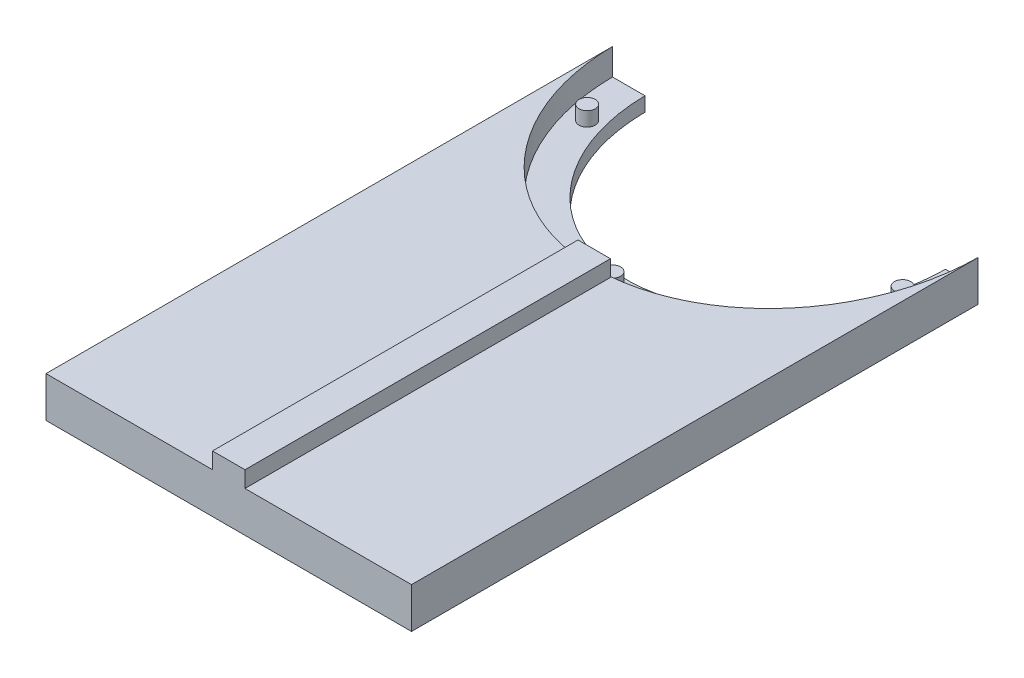
ISO-10303-21;
HEADER;
FILE_DESCRIPTION(('STEP AP214'),'2;1');
FILE_NAME('part.step','',(''),(''),'','','');
FILE_SCHEMA(('AUTOMOTIVE_DESIGN { 1 0 10303 214 1 1 1 1 }'));
ENDSEC;
DATA;
#1=APPLICATION_CONTEXT('core data for automotive mechanical design processes');
#2=APPLICATION_PROTOCOL_DEFINITION('international standard','automotive_design',2000,#1);
#3=PRODUCT_CONTEXT('',#1,'mechanical');
#4=PRODUCT('Part','Part','',(#3));
#5=PRODUCT_RELATED_PRODUCT_CATEGORY('part','',(#4));
#6=PRODUCT_DEFINITION_FORMATION('','',#4);
#7=PRODUCT_DEFINITION_CONTEXT('part definition',#1,'design');
#8=PRODUCT_DEFINITION('design','',#6,#7);
#9=PRODUCT_DEFINITION_SHAPE('','',#8);
#10=(LENGTH_UNIT() NAMED_UNIT(*) SI_UNIT(.MILLI.,.METRE.));
#11=(NAMED_UNIT(*) PLANE_ANGLE_UNIT() SI_UNIT($,.RADIAN.));
#12=(NAMED_UNIT(*) SI_UNIT($,.STERADIAN.) SOLID_ANGLE_UNIT());
#13=UNCERTAINTY_MEASURE_WITH_UNIT(LENGTH_MEASURE(1.E-05),#10,'distance_accuracy_value','');
#14=(GEOMETRIC_REPRESENTATION_CONTEXT(3) GLOBAL_UNCERTAINTY_ASSIGNED_CONTEXT((#13)) GLOBAL_UNIT_ASSIGNED_CONTEXT((#10,
#11,#12)) REPRESENTATION_CONTEXT('',''));
#15=CARTESIAN_POINT('',(0.,0.,0.));
#16=DIRECTION('',(0.,0.,1.));
#17=DIRECTION('',(1.,0.,0.));
#18=AXIS2_PLACEMENT_3D('',#15,#16,#17);
#19=CARTESIAN_POINT('',(0.,10.,0.));
#20=DIRECTION('',(0.,1.,0.));
#21=DIRECTION('',(0.,0.,1.));
#22=AXIS2_PLACEMENT_3D('',#19,#20,#21);
#23=PLANE('',#22);
#24=DIRECTION('',(0.,0.,-1.));
#25=VECTOR('',#24,1.);
#26=CARTESIAN_POINT('',(4.,10.,0.));
#27=LINE('',#26,#25);
#28=CARTESIAN_POINT('',(4.,10.,140.));
#29=VERTEX_POINT('',#28);
#30=CARTESIAN_POINT('',(4.,10.,50.));
#31=VERTEX_POINT('',#30);
#32=EDGE_CURVE('E11',#29,#31,#27,.T.);
#33=ORIENTED_EDGE('',*,*,#32,.F.);
#34=DIRECTION('',(1.,0.,0.));
#35=VECTOR('',#34,1.);
#36=CARTESIAN_POINT('',(0.,10.,140.));
#37=LINE('',#36,#35);
#38=CARTESIAN_POINT('',(45.,10.,140.));
#39=VERTEX_POINT('',#38);
#40=EDGE_CURVE('E232',#29,#39,#37,.T.);
#41=ORIENTED_EDGE('',*,*,#40,.T.);
#42=DIRECTION('',(0.,0.,-1.));
#43=VECTOR('',#42,1.);
#44=CARTESIAN_POINT('',(45.,10.,0.));
#45=LINE('',#44,#43);
#46=CARTESIAN_POINT('',(45.,10.,0.5));
#47=VERTEX_POINT('',#46);
#48=EDGE_CURVE('E351',#39,#47,#45,.T.);
#49=ORIENTED_EDGE('',*,*,#48,.T.);
#50=DIRECTION('',(1.,0.,0.));
#51=VECTOR('',#50,1.);
#52=CARTESIAN_POINT('',(0.,10.,0.5));
#53=LINE('',#52,#51);
#54=CARTESIAN_POINT('',(44.9977499437472,10.,0.5));
#55=VERTEX_POINT('',#54);
#56=EDGE_CURVE('E314',#55,#47,#53,.T.);
#57=ORIENTED_EDGE('',*,*,#56,.F.);
#58=CARTESIAN_POINT('',(0.,10.,0.));
#59=DIRECTION('',(0.,1.,0.));
#60=DIRECTION('',(0.,0.,1.));
#61=AXIS2_PLACEMENT_3D('',#58,#59,#60);
#62=ELLIPSE('',#61,50.,45.);
#63=CARTESIAN_POINT('',(0.,10.,50.));
#64=VERTEX_POINT('',#63);
#65=EDGE_CURVE('E336',#64,#55,#62,.T.);
#66=ORIENTED_EDGE('',*,*,#65,.F.);
#67=DIRECTION('',(-1.,0.,0.));
#68=VECTOR('',#67,1.);
#69=CARTESIAN_POINT('',(0.,10.,50.));
#70=LINE('',#69,#68);
#71=EDGE_CURVE('E62',#31,#64,#70,.T.);
#72=ORIENTED_EDGE('',*,*,#71,.F.);
#73=EDGE_LOOP('',(#33,#41,#49,#57,#66,#72));
#74=FACE_BOUND('',#73,.T.);
#75=ADVANCED_FACE('F45',(#74),#23,.T.);
#76=DIRECTION('',(0.,-1.,0.));
#77=VECTOR('',#76,1.);
#78=SURFACE_OF_LINEAR_EXTRUSION('',#62,#77);
#79=CARTESIAN_POINT('',(0.,3.5,0.));
#80=DIRECTION('',(0.,1.,0.));
#81=DIRECTION('',(0.,0.,1.));
#82=AXIS2_PLACEMENT_3D('',#79,#80,#81);
#83=ELLIPSE('',#82,50.,45.);
#84=CARTESIAN_POINT('',(-44.9977499437472,3.5,0.5));
#85=VERTEX_POINT('',#84);
#86=CARTESIAN_POINT('',(44.9977499437472,3.5,0.5));
#87=VERTEX_POINT('',#86);
#88=EDGE_CURVE('E316',#85,#87,#83,.T.);
#89=ORIENTED_EDGE('',*,*,#88,.F.);
#90=DIRECTION('',(0.,-1.,0.));
#91=VECTOR('',#90,1.);
#92=CARTESIAN_POINT('',(-44.9977499437472,10.,0.5));
#93=LINE('',#92,#91);
#94=CARTESIAN_POINT('',(-44.9977499437472,10.,0.5));
#95=VERTEX_POINT('',#94);
#96=EDGE_CURVE('E220',#95,#85,#93,.T.);
#97=ORIENTED_EDGE('',*,*,#96,.F.);
#98=EDGE_CURVE('E337',#95,#64,#62,.T.);
#99=ORIENTED_EDGE('',*,*,#98,.T.);
#100=ORIENTED_EDGE('',*,*,#65,.T.);
#101=DIRECTION('',(0.,-1.,0.));
#102=VECTOR('',#101,1.);
#103=CARTESIAN_POINT('',(44.9977499437472,10.,0.5));
#104=LINE('',#103,#102);
#105=EDGE_CURVE('E309',#55,#87,#104,.T.);
#106=ORIENTED_EDGE('',*,*,#105,.T.);
#107=EDGE_LOOP('',(#89,#97,#99,#100,#106));
#108=FACE_BOUND('',#107,.T.);
#109=ADVANCED_FACE('F47',(#108),#78,.T.);
#110=CARTESIAN_POINT('',(0.,10.,0.5));
#111=DIRECTION('',(0.,0.,-1.));
#112=DIRECTION('',(-1.,0.,0.));
#113=AXIS2_PLACEMENT_3D('',#110,#111,#112);
#114=PLANE('',#113);
#115=DIRECTION('',(1.,0.,0.));
#116=VECTOR('',#115,1.);
#117=CARTESIAN_POINT('',(0.,0.,0.5));
#118=LINE('',#117,#116);
#119=CARTESIAN_POINT('',(-45.,0.,0.5));
#120=VERTEX_POINT('',#119);
#121=CARTESIAN_POINT('',(-36.9973577680352,0.,0.5));
#122=VERTEX_POINT('',#121);
#123=EDGE_CURVE('E276',#120,#122,#118,.T.);
#124=ORIENTED_EDGE('',*,*,#123,.F.);
#125=DIRECTION('',(0.,-1.,0.));
#126=VECTOR('',#125,1.);
#127=CARTESIAN_POINT('',(-45.,10.,0.5));
#128=LINE('',#127,#126);
#129=CARTESIAN_POINT('',(-45.,10.,0.5));
#130=VERTEX_POINT('',#129);
#131=EDGE_CURVE('E279',#130,#120,#128,.T.);
#132=ORIENTED_EDGE('',*,*,#131,.F.);
#133=EDGE_CURVE('E341',#130,#95,#53,.T.);
#134=ORIENTED_EDGE('',*,*,#133,.T.);
#135=ORIENTED_EDGE('',*,*,#96,.T.);
#136=DIRECTION('',(1.,0.,0.));
#137=VECTOR('',#136,1.);
#138=CARTESIAN_POINT('',(0.,3.5,0.5));
#139=LINE('',#138,#137);
#140=CARTESIAN_POINT('',(-36.9973577680352,3.5,0.5));
#141=VERTEX_POINT('',#140);
#142=EDGE_CURVE('E201',#85,#141,#139,.T.);
#143=ORIENTED_EDGE('',*,*,#142,.T.);
#144=DIRECTION('',(0.,-1.,0.));
#145=VECTOR('',#144,1.);
#146=CARTESIAN_POINT('',(-36.9973577680352,3.5,0.5));
#147=LINE('',#146,#145);
#148=EDGE_CURVE('E282',#141,#122,#147,.T.);
#149=ORIENTED_EDGE('',*,*,#148,.T.);
#150=EDGE_LOOP('',(#124,#132,#134,#135,#143,#149));
#151=FACE_BOUND('',#150,.T.);
#152=ADVANCED_FACE('F246',(#151),#114,.T.);
#153=CARTESIAN_POINT('',(-45.,10.,0.));
#154=DIRECTION('',(-1.,0.,0.));
#155=DIRECTION('',(0.,0.,1.));
#156=AXIS2_PLACEMENT_3D('',#153,#154,#155);
#157=PLANE('',#156);
#158=DIRECTION('',(0.,0.,-1.));
#159=VECTOR('',#158,1.);
#160=CARTESIAN_POINT('',(-45.,0.,0.));
#161=LINE('',#160,#159);
#162=CARTESIAN_POINT('',(-45.,0.,140.));
#163=VERTEX_POINT('',#162);
#164=EDGE_CURVE('E286',#163,#120,#161,.T.);
#165=ORIENTED_EDGE('',*,*,#164,.F.);
#166=DIRECTION('',(0.,-1.,0.));
#167=VECTOR('',#166,1.);
#168=CARTESIAN_POINT('',(-45.,10.,140.));
#169=LINE('',#168,#167);
#170=CARTESIAN_POINT('',(-45.,10.,140.));
#171=VERTEX_POINT('',#170);
#172=EDGE_CURVE('E363',#171,#163,#169,.T.);
#173=ORIENTED_EDGE('',*,*,#172,.F.);
#174=DIRECTION('',(0.,0.,-1.));
#175=VECTOR('',#174,1.);
#176=CARTESIAN_POINT('',(-45.,10.,0.));
#177=LINE('',#176,#175);
#178=EDGE_CURVE('E238',#171,#130,#177,.T.);
#179=ORIENTED_EDGE('',*,*,#178,.T.);
#180=ORIENTED_EDGE('',*,*,#131,.T.);
#181=EDGE_LOOP('',(#165,#173,#179,#180));
#182=FACE_BOUND('',#181,.T.);
#183=ADVANCED_FACE('F268',(#182),#157,.T.);
#184=CARTESIAN_POINT('',(0.,10.,140.));
#185=DIRECTION('',(0.,0.,-1.));
#186=DIRECTION('',(-1.,0.,0.));
#187=AXIS2_PLACEMENT_3D('',#184,#185,#186);
#188=PLANE('',#187);
#189=ORIENTED_EDGE('',*,*,#40,.F.);
#190=DIRECTION('',(0.,1.,0.));
#191=VECTOR('',#190,1.);
#192=CARTESIAN_POINT('',(4.,6.,140.));
#193=LINE('',#192,#191);
#194=CARTESIAN_POINT('',(4.,14.,140.));
#195=VERTEX_POINT('',#194);
#196=EDGE_CURVE('E168',#29,#195,#193,.T.);
#197=ORIENTED_EDGE('',*,*,#196,.T.);
#198=DIRECTION('',(-1.,0.,0.));
#199=VECTOR('',#198,1.);
#200=CARTESIAN_POINT('',(-4.,14.,140.));
#201=LINE('',#200,#199);
#202=CARTESIAN_POINT('',(-4.,14.,140.));
#203=VERTEX_POINT('',#202);
#204=EDGE_CURVE('E155',#195,#203,#201,.T.);
#205=ORIENTED_EDGE('',*,*,#204,.T.);
#206=DIRECTION('',(0.,-1.,0.));
#207=VECTOR('',#206,1.);
#208=CARTESIAN_POINT('',(-4.,6.,140.));
#209=LINE('',#208,#207);
#210=CARTESIAN_POINT('',(-4.,10.,140.));
#211=VERTEX_POINT('',#210);
#212=EDGE_CURVE('E149',#203,#211,#209,.T.);
#213=ORIENTED_EDGE('',*,*,#212,.T.);
#214=EDGE_CURVE('E237',#171,#211,#37,.T.);
#215=ORIENTED_EDGE('',*,*,#214,.F.);
#216=ORIENTED_EDGE('',*,*,#172,.T.);
#217=DIRECTION('',(1.,0.,0.));
#218=VECTOR('',#217,1.);
#219=CARTESIAN_POINT('',(0.,0.,140.));
#220=LINE('',#219,#218);
#221=CARTESIAN_POINT('',(45.,0.,140.));
#222=VERTEX_POINT('',#221);
#223=EDGE_CURVE('E293',#163,#222,#220,.T.);
#224=ORIENTED_EDGE('',*,*,#223,.T.);
#225=DIRECTION('',(0.,-1.,0.));
#226=VECTOR('',#225,1.);
#227=CARTESIAN_POINT('',(45.,10.,140.));
#228=LINE('',#227,#226);
#229=EDGE_CURVE('E234',#39,#222,#228,.T.);
#230=ORIENTED_EDGE('',*,*,#229,.F.);
#231=EDGE_LOOP('',(#189,#197,#205,#213,#215,#216,#224,#230));
#232=FACE_BOUND('',#231,.T.);
#233=ADVANCED_FACE('F230',(#232),#188,.F.);
#234=CARTESIAN_POINT('',(45.,10.,0.));
#235=DIRECTION('',(-1.,0.,0.));
#236=DIRECTION('',(0.,0.,1.));
#237=AXIS2_PLACEMENT_3D('',#234,#235,#236);
#238=PLANE('',#237);
#239=DIRECTION('',(0.,0.,-1.));
#240=VECTOR('',#239,1.);
#241=CARTESIAN_POINT('',(45.,0.,0.));
#242=LINE('',#241,#240);
#243=CARTESIAN_POINT('',(45.,0.,0.5));
#244=VERTEX_POINT('',#243);
#245=EDGE_CURVE('E297',#222,#244,#242,.T.);
#246=ORIENTED_EDGE('',*,*,#245,.T.);
#247=DIRECTION('',(0.,-1.,0.));
#248=VECTOR('',#247,1.);
#249=CARTESIAN_POINT('',(45.,10.,0.5));
#250=LINE('',#249,#248);
#251=EDGE_CURVE('E306',#47,#244,#250,.T.);
#252=ORIENTED_EDGE('',*,*,#251,.F.);
#253=ORIENTED_EDGE('',*,*,#48,.F.);
#254=ORIENTED_EDGE('',*,*,#229,.T.);
#255=EDGE_LOOP('',(#246,#252,#253,#254));
#256=FACE_BOUND('',#255,.T.);
#257=ADVANCED_FACE('F259',(#256),#238,.F.);
#258=CARTESIAN_POINT('',(36.9973577680352,0.,0.5));
#259=VERTEX_POINT('',#258);
#260=EDGE_CURVE('E289',#259,#244,#118,.T.);
#261=ORIENTED_EDGE('',*,*,#260,.F.);
#262=DIRECTION('',(0.,-1.,0.));
#263=VECTOR('',#262,1.);
#264=CARTESIAN_POINT('',(36.9973577680352,3.5,0.5));
#265=LINE('',#264,#263);
#266=CARTESIAN_POINT('',(36.9973577680352,3.5,0.5));
#267=VERTEX_POINT('',#266);
#268=EDGE_CURVE('E287',#267,#259,#265,.T.);
#269=ORIENTED_EDGE('',*,*,#268,.F.);
#270=EDGE_CURVE('E204',#267,#87,#139,.T.);
#271=ORIENTED_EDGE('',*,*,#270,.T.);
#272=ORIENTED_EDGE('',*,*,#105,.F.);
#273=ORIENTED_EDGE('',*,*,#56,.T.);
#274=ORIENTED_EDGE('',*,*,#251,.T.);
#275=EDGE_LOOP('',(#261,#269,#271,#272,#273,#274));
#276=FACE_BOUND('',#275,.T.);
#277=ADVANCED_FACE('F252',(#276),#114,.T.);
#278=DIRECTION('',(0.,0.,1.));
#279=VECTOR('',#278,1.);
#280=CARTESIAN_POINT('',(-4.,10.,0.));
#281=LINE('',#280,#279);
#282=CARTESIAN_POINT('',(-4.,10.,50.));
#283=VERTEX_POINT('',#282);
#284=EDGE_CURVE('E55',#283,#211,#281,.T.);
#285=ORIENTED_EDGE('',*,*,#284,.F.);
#286=EDGE_CURVE('E219',#64,#283,#70,.T.);
#287=ORIENTED_EDGE('',*,*,#286,.F.);
#288=ORIENTED_EDGE('',*,*,#98,.F.);
#289=ORIENTED_EDGE('',*,*,#133,.F.);
#290=ORIENTED_EDGE('',*,*,#178,.F.);
#291=ORIENTED_EDGE('',*,*,#214,.T.);
#292=EDGE_LOOP('',(#285,#287,#288,#289,#290,#291));
#293=FACE_BOUND('',#292,.T.);
#294=ADVANCED_FACE('F242',(#293),#23,.T.);
#295=CARTESIAN_POINT('',(0.,0.,0.));
#296=DIRECTION('',(0.,1.,0.));
#297=DIRECTION('',(0.,0.,1.));
#298=AXIS2_PLACEMENT_3D('',#295,#296,#297);
#299=PLANE('',#298);
#300=ORIENTED_EDGE('',*,*,#123,.T.);
#301=CARTESIAN_POINT('',(0.,0.,-42.));
#302=CARTESIAN_POINT('',(-4.93138164351082,0.,-42.));
#303=CARTESIAN_POINT('',(-14.7941449305325,0.,-39.7237391442364));
#304=CARTESIAN_POINT('',(-27.0896008441229,0.,-30.2004855000218));
#305=CARTESIAN_POINT('',(-35.1368792596779,0.,-16.2564691599312));
#306=CARTESIAN_POINT('',(-37.931560370161,0.,0.));
#307=CARTESIAN_POINT('',(-35.1368792596779,0.,16.2564691599312));
#308=CARTESIAN_POINT('',(-27.0896008441229,0.,30.2004855000218));
#309=CARTESIAN_POINT('',(-14.7941449305325,0.,39.7237391442364));
#310=CARTESIAN_POINT('',(0.,0.,43.1381304278818));
#311=CARTESIAN_POINT('',(14.7941449305325,0.,39.7237391442364));
#312=CARTESIAN_POINT('',(27.0896008441229,0.,30.2004855000219));
#313=CARTESIAN_POINT('',(35.1368792596779,0.,16.2564691599312));
#314=CARTESIAN_POINT('',(37.931560370161,0.,0.));
#315=CARTESIAN_POINT('',(35.1368792596779,0.,-16.2564691599312));
#316=CARTESIAN_POINT('',(27.0896008441229,0.,-30.2004855000218));
#317=CARTESIAN_POINT('',(14.7941449305325,0.,-39.7237391442364));
#318=CARTESIAN_POINT('',(4.93138164351083,0.,-42.));
#319=CARTESIAN_POINT('',(0.,0.,-42.));
#320=B_SPLINE_CURVE_WITH_KNOTS('',3,(#301,#302,#303,#304,#305,#306,#307,#308,#309,#310,#311,
#312,#313,#314,#315,#316,#317,#318,#319),.UNSPECIFIED.,.T.,.F.,(4,1,1,1,1,1,1,1,1,1,1,1,1,1,1,1,
4),(0.,0.392699081698724,0.785398163397448,1.17809724509617,1.5707963267949,1.96349540849362,
2.35619449019234,2.74889357189107,3.14159265358979,3.53429173528852,3.92699081698724,
4.31968989868597,4.71238898038469,5.10508806208341,5.49778714378214,5.89048622548086,
6.28318530717959),.UNSPECIFIED.);
#321=EDGE_CURVE('E208',#122,#259,#320,.T.);
#322=ORIENTED_EDGE('',*,*,#321,.T.);
#323=ORIENTED_EDGE('',*,*,#260,.T.);
#324=ORIENTED_EDGE('',*,*,#245,.F.);
#325=ORIENTED_EDGE('',*,*,#223,.F.);
#326=ORIENTED_EDGE('',*,*,#164,.T.);
#327=EDGE_LOOP('',(#300,#322,#323,#324,#325,#326));
#328=FACE_BOUND('',#327,.T.);
#329=ADVANCED_FACE('F251',(#328),#299,.F.);
#330=CARTESIAN_POINT('',(0.,3.5,-42.));
#331=CARTESIAN_POINT('',(-4.93138164351082,3.5,-42.));
#332=CARTESIAN_POINT('',(-14.7941449305325,3.5,-39.7237391442364));
#333=CARTESIAN_POINT('',(-27.0896008441229,3.5,-30.2004855000218));
#334=CARTESIAN_POINT('',(-35.1368792596779,3.5,-16.2564691599312));
#335=CARTESIAN_POINT('',(-37.931560370161,3.5,0.));
#336=CARTESIAN_POINT('',(-35.1368792596779,3.5,16.2564691599312));
#337=CARTESIAN_POINT('',(-27.0896008441229,3.5,30.2004855000218));
#338=CARTESIAN_POINT('',(-14.7941449305325,3.5,39.7237391442364));
#339=CARTESIAN_POINT('',(0.,3.5,43.1381304278818));
#340=CARTESIAN_POINT('',(14.7941449305325,3.5,39.7237391442364));
#341=CARTESIAN_POINT('',(27.0896008441229,3.5,30.2004855000219));
#342=CARTESIAN_POINT('',(35.1368792596779,3.5,16.2564691599312));
#343=CARTESIAN_POINT('',(37.931560370161,3.5,0.));
#344=CARTESIAN_POINT('',(35.1368792596779,3.5,-16.2564691599312));
#345=CARTESIAN_POINT('',(27.0896008441229,3.5,-30.2004855000218));
#346=CARTESIAN_POINT('',(14.7941449305325,3.5,-39.7237391442364));
#347=CARTESIAN_POINT('',(4.93138164351083,3.5,-42.));
#348=CARTESIAN_POINT('',(0.,3.5,-42.));
#349=B_SPLINE_CURVE_WITH_KNOTS('',3,(#330,#331,#332,#333,#334,#335,#336,#337,#338,#339,#340,
#341,#342,#343,#344,#345,#346,#347,#348),.UNSPECIFIED.,.T.,.F.,(4,1,1,1,1,1,1,1,1,1,1,1,1,1,1,1,
4),(0.,0.392699081698724,0.785398163397448,1.17809724509617,1.5707963267949,1.96349540849362,
2.35619449019234,2.74889357189107,3.14159265358979,3.53429173528852,3.92699081698724,
4.31968989868597,4.71238898038469,5.10508806208341,5.49778714378214,5.89048622548086,
6.28318530717959),.UNSPECIFIED.);
#350=DIRECTION('',(0.,-1.,0.));
#351=VECTOR('',#350,1.);
#352=SURFACE_OF_LINEAR_EXTRUSION('',#349,#351);
#353=ORIENTED_EDGE('',*,*,#321,.F.);
#354=ORIENTED_EDGE('',*,*,#148,.F.);
#355=EDGE_CURVE('E194',#141,#267,#349,.T.);
#356=ORIENTED_EDGE('',*,*,#355,.T.);
#357=ORIENTED_EDGE('',*,*,#268,.T.);
#358=EDGE_LOOP('',(#353,#354,#356,#357));
#359=FACE_BOUND('',#358,.T.);
#360=ADVANCED_FACE('F257',(#359),#352,.T.);
#361=CARTESIAN_POINT('',(0.,3.5,0.));
#362=DIRECTION('',(0.,1.,0.));
#363=DIRECTION('',(0.,0.,1.));
#364=AXIS2_PLACEMENT_3D('',#361,#362,#363);
#365=PLANE('',#364);
#366=CARTESIAN_POINT('',(38.8404838015386,3.5,12.9089643673815));
#367=DIRECTION('',(0.,1.,0.));
#368=DIRECTION('',(0.,0.,1.));
#369=AXIS2_PLACEMENT_3D('',#366,#367,#368);
#370=CIRCLE('',#369,2.);
#371=CARTESIAN_POINT('',(38.8404838015386,3.5,14.9089643673815));
#372=VERTEX_POINT('',#371);
#373=EDGE_CURVE('E215',#372,#372,#370,.T.);
#374=ORIENTED_EDGE('',*,*,#373,.F.);
#375=EDGE_LOOP('',(#374));
#376=FACE_BOUND('',#375,.T.);
#377=CARTESIAN_POINT('',(0.,3.5,45.5));
#378=DIRECTION('',(0.,1.,0.));
#379=DIRECTION('',(0.,0.,1.));
#380=AXIS2_PLACEMENT_3D('',#377,#378,#379);
#381=CIRCLE('',#380,2.);
#382=CARTESIAN_POINT('',(0.,3.5,47.5));
#383=VERTEX_POINT('',#382);
#384=EDGE_CURVE('E186',#383,#383,#381,.F.);
#385=ORIENTED_EDGE('',*,*,#384,.T.);
#386=EDGE_LOOP('',(#385));
#387=FACE_BOUND('',#386,.T.);
#388=CARTESIAN_POINT('',(-38.8404838015386,3.5,12.9089643673815));
#389=DIRECTION('',(0.,1.,0.));
#390=DIRECTION('',(0.,0.,1.));
#391=AXIS2_PLACEMENT_3D('',#388,#389,#390);
#392=CIRCLE('',#391,2.);
#393=CARTESIAN_POINT('',(-38.8404838015386,3.5,14.9089643673815));
#394=VERTEX_POINT('',#393);
#395=EDGE_CURVE('E191',#394,#394,#392,.F.);
#396=ORIENTED_EDGE('',*,*,#395,.T.);
#397=EDGE_LOOP('',(#396));
#398=FACE_BOUND('',#397,.T.);
#399=ORIENTED_EDGE('',*,*,#270,.F.);
#400=ORIENTED_EDGE('',*,*,#355,.F.);
#401=ORIENTED_EDGE('',*,*,#142,.F.);
#402=ORIENTED_EDGE('',*,*,#88,.T.);
#403=EDGE_LOOP('',(#399,#400,#401,#402));
#404=FACE_BOUND('',#403,.T.);
#405=ADVANCED_FACE('F331',(#376,#387,#398,#404),#365,.T.);
#406=CARTESIAN_POINT('',(-38.8404838015386,7.,12.9089643673815));
#407=DIRECTION('',(0.,-1.,0.));
#408=DIRECTION('',(0.,0.,-1.));
#409=AXIS2_PLACEMENT_3D('',#406,#407,#408);
#410=CYLINDRICAL_SURFACE('',#409,2.);
#411=ORIENTED_EDGE('',*,*,#395,.F.);
#412=EDGE_LOOP('',(#411));
#413=FACE_BOUND('',#412,.T.);
#414=CARTESIAN_POINT('',(-38.8404838015386,7.,12.9089643673815));
#415=DIRECTION('',(0.,1.,0.));
#416=DIRECTION('',(0.,0.,1.));
#417=AXIS2_PLACEMENT_3D('',#414,#415,#416);
#418=CIRCLE('',#417,2.);
#419=CARTESIAN_POINT('',(-38.8404838015386,7.,14.9089643673815));
#420=VERTEX_POINT('',#419);
#421=EDGE_CURVE('E187',#420,#420,#418,.T.);
#422=ORIENTED_EDGE('',*,*,#421,.F.);
#423=EDGE_LOOP('',(#422));
#424=FACE_BOUND('',#423,.T.);
#425=ADVANCED_FACE('F373',(#413,#424),#410,.T.);
#426=CARTESIAN_POINT('',(-38.8404838015386,7.,12.9089643673815));
#427=DIRECTION('',(0.,1.,0.));
#428=DIRECTION('',(0.,0.,1.));
#429=AXIS2_PLACEMENT_3D('',#426,#427,#428);
#430=PLANE('',#429);
#431=ORIENTED_EDGE('',*,*,#421,.T.);
#432=EDGE_LOOP('',(#431));
#433=FACE_BOUND('',#432,.T.);
#434=ADVANCED_FACE('F380',(#433),#430,.T.);
#435=CARTESIAN_POINT('',(0.,7.,45.5));
#436=DIRECTION('',(0.,-1.,0.));
#437=DIRECTION('',(0.,0.,-1.));
#438=AXIS2_PLACEMENT_3D('',#435,#436,#437);
#439=CYLINDRICAL_SURFACE('',#438,2.);
#440=ORIENTED_EDGE('',*,*,#384,.F.);
#441=EDGE_LOOP('',(#440));
#442=FACE_BOUND('',#441,.T.);
#443=CARTESIAN_POINT('',(0.,7.,45.5));
#444=DIRECTION('',(0.,1.,0.));
#445=DIRECTION('',(0.,0.,1.));
#446=AXIS2_PLACEMENT_3D('',#443,#444,#445);
#447=CIRCLE('',#446,2.);
#448=CARTESIAN_POINT('',(0.,7.,47.5));
#449=VERTEX_POINT('',#448);
#450=EDGE_CURVE('E182',#449,#449,#447,.T.);
#451=ORIENTED_EDGE('',*,*,#450,.F.);
#452=EDGE_LOOP('',(#451));
#453=FACE_BOUND('',#452,.T.);
#454=ADVANCED_FACE('F388',(#442,#453),#439,.T.);
#455=CARTESIAN_POINT('',(0.,7.,45.5));
#456=DIRECTION('',(0.,1.,0.));
#457=DIRECTION('',(0.,0.,1.));
#458=AXIS2_PLACEMENT_3D('',#455,#456,#457);
#459=PLANE('',#458);
#460=ORIENTED_EDGE('',*,*,#450,.T.);
#461=EDGE_LOOP('',(#460));
#462=FACE_BOUND('',#461,.T.);
#463=ADVANCED_FACE('F390',(#462),#459,.T.);
#464=CARTESIAN_POINT('',(38.8404838015386,7.,12.9089643673815));
#465=DIRECTION('',(0.,-1.,0.));
#466=DIRECTION('',(0.,0.,-1.));
#467=AXIS2_PLACEMENT_3D('',#464,#465,#466);
#468=CYLINDRICAL_SURFACE('',#467,2.);
#469=ORIENTED_EDGE('',*,*,#373,.T.);
#470=EDGE_LOOP('',(#469));
#471=FACE_BOUND('',#470,.T.);
#472=CARTESIAN_POINT('',(38.8404838015386,7.,12.9089643673815));
#473=DIRECTION('',(0.,-1.,0.));
#474=DIRECTION('',(0.,0.,-1.));
#475=AXIS2_PLACEMENT_3D('',#472,#473,#474);
#476=CIRCLE('',#475,2.);
#477=CARTESIAN_POINT('',(38.8404838015386,7.,10.9089643673815));
#478=VERTEX_POINT('',#477);
#479=EDGE_CURVE('E177',#478,#478,#476,.T.);
#480=ORIENTED_EDGE('',*,*,#479,.T.);
#481=EDGE_LOOP('',(#480));
#482=FACE_BOUND('',#481,.T.);
#483=ADVANCED_FACE('F393',(#471,#482),#468,.T.);
#484=CARTESIAN_POINT('',(38.8404838015386,7.,12.9089643673815));
#485=DIRECTION('',(0.,-1.,0.));
#486=DIRECTION('',(0.,0.,-1.));
#487=AXIS2_PLACEMENT_3D('',#484,#485,#486);
#488=PLANE('',#487);
#489=ORIENTED_EDGE('',*,*,#479,.F.);
#490=EDGE_LOOP('',(#489));
#491=FACE_BOUND('',#490,.T.);
#492=ADVANCED_FACE('F398',(#491),#488,.F.);
#493=CARTESIAN_POINT('',(4.,6.,50.));
#494=DIRECTION('',(1.,0.,0.));
#495=DIRECTION('',(0.,0.,-1.));
#496=AXIS2_PLACEMENT_3D('',#493,#494,#495);
#497=PLANE('',#496);
#498=ORIENTED_EDGE('',*,*,#196,.F.);
#499=ORIENTED_EDGE('',*,*,#32,.T.);
#500=DIRECTION('',(0.,1.,0.));
#501=VECTOR('',#500,1.);
#502=CARTESIAN_POINT('',(4.,6.,50.));
#503=LINE('',#502,#501);
#504=CARTESIAN_POINT('',(4.,14.,50.));
#505=VERTEX_POINT('',#504);
#506=EDGE_CURVE('E139',#31,#505,#503,.T.);
#507=ORIENTED_EDGE('',*,*,#506,.T.);
#508=DIRECTION('',(0.,0.,1.));
#509=VECTOR('',#508,1.);
#510=CARTESIAN_POINT('',(4.,14.,50.));
#511=LINE('',#510,#509);
#512=EDGE_CURVE('E143',#505,#195,#511,.T.);
#513=ORIENTED_EDGE('',*,*,#512,.T.);
#514=EDGE_LOOP('',(#498,#499,#507,#513));
#515=FACE_BOUND('',#514,.T.);
#516=ADVANCED_FACE('F142',(#515),#497,.T.);
#517=CARTESIAN_POINT('',(-4.,6.,50.));
#518=DIRECTION('',(-1.,0.,0.));
#519=DIRECTION('',(0.,0.,1.));
#520=AXIS2_PLACEMENT_3D('',#517,#518,#519);
#521=PLANE('',#520);
#522=DIRECTION('',(0.,-1.,0.));
#523=VECTOR('',#522,1.);
#524=CARTESIAN_POINT('',(-4.,6.,50.));
#525=LINE('',#524,#523);
#526=CARTESIAN_POINT('',(-4.,14.,50.));
#527=VERTEX_POINT('',#526);
#528=EDGE_CURVE('E158',#527,#283,#525,.T.);
#529=ORIENTED_EDGE('',*,*,#528,.T.);
#530=ORIENTED_EDGE('',*,*,#284,.T.);
#531=ORIENTED_EDGE('',*,*,#212,.F.);
#532=DIRECTION('',(0.,0.,1.));
#533=VECTOR('',#532,1.);
#534=CARTESIAN_POINT('',(-4.,14.,50.));
#535=LINE('',#534,#533);
#536=EDGE_CURVE('E157',#527,#203,#535,.T.);
#537=ORIENTED_EDGE('',*,*,#536,.F.);
#538=EDGE_LOOP('',(#529,#530,#531,#537));
#539=FACE_BOUND('',#538,.T.);
#540=ADVANCED_FACE('F227',(#539),#521,.T.);
#541=CARTESIAN_POINT('',(-4.,14.,50.));
#542=DIRECTION('',(0.,1.,0.));
#543=DIRECTION('',(0.,0.,1.));
#544=AXIS2_PLACEMENT_3D('',#541,#542,#543);
#545=PLANE('',#544);
#546=ORIENTED_EDGE('',*,*,#204,.F.);
#547=ORIENTED_EDGE('',*,*,#512,.F.);
#548=DIRECTION('',(-1.,0.,0.));
#549=VECTOR('',#548,1.);
#550=CARTESIAN_POINT('',(-4.,14.,50.));
#551=LINE('',#550,#549);
#552=EDGE_CURVE('E148',#505,#527,#551,.T.);
#553=ORIENTED_EDGE('',*,*,#552,.T.);
#554=ORIENTED_EDGE('',*,*,#536,.T.);
#555=EDGE_LOOP('',(#546,#547,#553,#554));
#556=FACE_BOUND('',#555,.T.);
#557=ADVANCED_FACE('F153',(#556),#545,.T.);
#558=CARTESIAN_POINT('',(0.,0.,50.));
#559=DIRECTION('',(0.,0.,-1.));
#560=DIRECTION('',(-1.,0.,0.));
#561=AXIS2_PLACEMENT_3D('',#558,#559,#560);
#562=PLANE('',#561);
#563=ORIENTED_EDGE('',*,*,#506,.F.);
#564=ORIENTED_EDGE('',*,*,#71,.T.);
#565=ORIENTED_EDGE('',*,*,#286,.T.);
#566=ORIENTED_EDGE('',*,*,#528,.F.);
#567=ORIENTED_EDGE('',*,*,#552,.F.);
#568=EDGE_LOOP('',(#563,#564,#565,#566,#567));
#569=FACE_BOUND('',#568,.T.);
#570=ADVANCED_FACE('F161',(#569),#562,.T.);
#571=CLOSED_SHELL('',(#75,#109,#152,#183,#233,#257,#277,#294,#329,#360,#405,#425,#434,#454,#463,
#483,#492,#516,#540,#557,#570));
#572=MANIFOLD_SOLID_BREP('B2',#571);
#573=ADVANCED_BREP_SHAPE_REPRESENTATION('',(#18,#572),#14);
#574=SHAPE_DEFINITION_REPRESENTATION(#9,#573);
ENDSEC;
END-ISO-10303-21;
